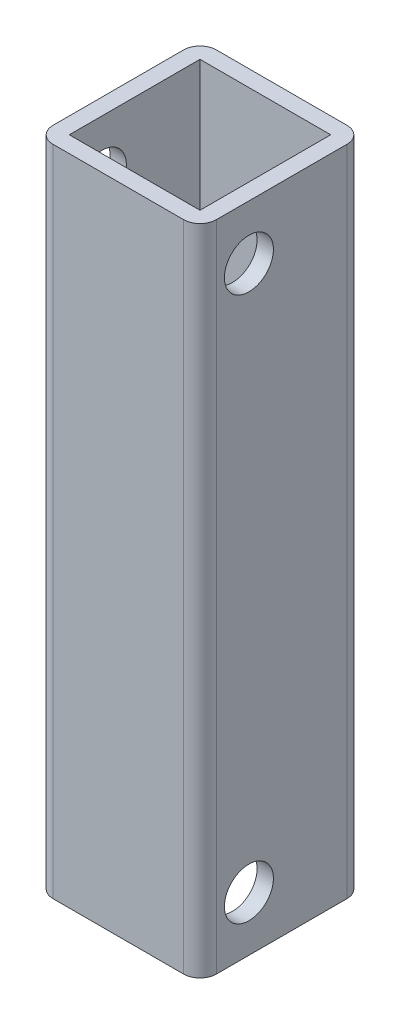
ISO-10303-21;
HEADER;
FILE_DESCRIPTION(('STEP AP214'),'2;1');
FILE_NAME('part.step','',(''),(''),'','','');
FILE_SCHEMA(('AUTOMOTIVE_DESIGN { 1 0 10303 214 1 1 1 1 }'));
ENDSEC;
DATA;
#1=APPLICATION_CONTEXT('core data for automotive mechanical design processes');
#2=APPLICATION_PROTOCOL_DEFINITION('international standard','automotive_design',2000,#1);
#3=PRODUCT_CONTEXT('',#1,'mechanical');
#4=PRODUCT('Part','Part','',(#3));
#5=PRODUCT_RELATED_PRODUCT_CATEGORY('part','',(#4));
#6=PRODUCT_DEFINITION_FORMATION('','',#4);
#7=PRODUCT_DEFINITION_CONTEXT('part definition',#1,'design');
#8=PRODUCT_DEFINITION('design','',#6,#7);
#9=PRODUCT_DEFINITION_SHAPE('','',#8);
#10=(LENGTH_UNIT() NAMED_UNIT(*) SI_UNIT(.MILLI.,.METRE.));
#11=(NAMED_UNIT(*) PLANE_ANGLE_UNIT() SI_UNIT($,.RADIAN.));
#12=(NAMED_UNIT(*) SI_UNIT($,.STERADIAN.) SOLID_ANGLE_UNIT());
#13=UNCERTAINTY_MEASURE_WITH_UNIT(LENGTH_MEASURE(1.E-05),#10,'distance_accuracy_value','');
#14=(GEOMETRIC_REPRESENTATION_CONTEXT(3) GLOBAL_UNCERTAINTY_ASSIGNED_CONTEXT((#13)) GLOBAL_UNIT_ASSIGNED_CONTEXT((#10,
#11,#12)) REPRESENTATION_CONTEXT('',''));
#15=CARTESIAN_POINT('',(0.,0.,0.));
#16=DIRECTION('',(0.,0.,1.));
#17=DIRECTION('',(1.,0.,0.));
#18=AXIS2_PLACEMENT_3D('',#15,#16,#17);
#19=CARTESIAN_POINT('',(-15.,507.9,-50.1201374153035));
#20=DIRECTION('',(-1.,0.,0.));
#21=DIRECTION('',(0.,0.,1.));
#22=AXIS2_PLACEMENT_3D('',#19,#20,#21);
#23=PLANE('',#22);
#24=CARTESIAN_POINT('',(-15.,397.934499999996,-29.1000000000331));
#25=DIRECTION('',(1.,0.,0.));
#26=DIRECTION('',(0.,0.,-1.));
#27=AXIS2_PLACEMENT_3D('',#24,#25,#26);
#28=CIRCLE('',#27,4.5);
#29=CARTESIAN_POINT('',(-15.,397.934499999996,-33.6000000000331));
#30=VERTEX_POINT('',#29);
#31=EDGE_CURVE('E423',#30,#30,#28,.T.);
#32=ORIENTED_EDGE('',*,*,#31,.T.);
#33=EDGE_LOOP('',(#32));
#34=FACE_BOUND('',#33,.T.);
#35=CARTESIAN_POINT('',(-15.,497.934499999996,-29.1000000000432));
#36=DIRECTION('',(1.,0.,0.));
#37=DIRECTION('',(0.,0.,-1.));
#38=AXIS2_PLACEMENT_3D('',#35,#36,#37);
#39=CIRCLE('',#38,4.5);
#40=CARTESIAN_POINT('',(-15.,497.934499999996,-33.6000000000432));
#41=VERTEX_POINT('',#40);
#42=EDGE_CURVE('E154',#41,#41,#39,.T.);
#43=ORIENTED_EDGE('',*,*,#42,.T.);
#44=EDGE_LOOP('',(#43));
#45=FACE_BOUND('',#44,.T.);
#46=DIRECTION('',(0.,0.,1.));
#47=VECTOR('',#46,1.);
#48=CARTESIAN_POINT('',(-15.,507.9,-50.1201374153035));
#49=LINE('',#48,#47);
#50=CARTESIAN_POINT('',(-15.,507.9,-47.1201374153035));
#51=VERTEX_POINT('',#50);
#52=CARTESIAN_POINT('',(-15.,507.9,-23.1201374153035));
#53=VERTEX_POINT('',#52);
#54=EDGE_CURVE('E182',#51,#53,#49,.T.);
#55=ORIENTED_EDGE('',*,*,#54,.F.);
#56=DIRECTION('',(0.,-1.,0.));
#57=VECTOR('',#56,1.);
#58=CARTESIAN_POINT('',(-15.,387.934536743125,-47.1201374153035));
#59=LINE('',#58,#57);
#60=CARTESIAN_POINT('',(-15.,387.934536743125,-47.1201374153035));
#61=VERTEX_POINT('',#60);
#62=EDGE_CURVE('E217',#51,#61,#59,.T.);
#63=ORIENTED_EDGE('',*,*,#62,.T.);
#64=DIRECTION('',(0.,0.,1.));
#65=VECTOR('',#64,1.);
#66=CARTESIAN_POINT('',(-15.,387.934536743125,-50.1201374153035));
#67=LINE('',#66,#65);
#68=CARTESIAN_POINT('',(-15.,387.934536743125,-23.1201374153035));
#69=VERTEX_POINT('',#68);
#70=EDGE_CURVE('E177',#61,#69,#67,.T.);
#71=ORIENTED_EDGE('',*,*,#70,.T.);
#72=DIRECTION('',(0.,-1.,0.));
#73=VECTOR('',#72,1.);
#74=CARTESIAN_POINT('',(-15.,507.9,-23.1201374153035));
#75=LINE('',#74,#73);
#76=EDGE_CURVE('E215',#69,#53,#75,.F.);
#77=ORIENTED_EDGE('',*,*,#76,.T.);
#78=EDGE_LOOP('',(#55,#63,#71,#77));
#79=FACE_BOUND('',#78,.T.);
#80=ADVANCED_FACE('F33',(#34,#45,#79),#23,.T.);
#81=CARTESIAN_POINT('',(15.,507.9,-50.1201374153035));
#82=DIRECTION('',(0.,1.,0.));
#83=DIRECTION('',(0.,0.,1.));
#84=AXIS2_PLACEMENT_3D('',#81,#82,#83);
#85=PLANE('',#84);
#86=DIRECTION('',(0.,0.,1.));
#87=VECTOR('',#86,1.);
#88=CARTESIAN_POINT('',(-12.,507.9,-47.1201374153035));
#89=LINE('',#88,#87);
#90=CARTESIAN_POINT('',(-12.,507.9,-47.1201374153035));
#91=VERTEX_POINT('',#90);
#92=CARTESIAN_POINT('',(-12.,507.9,-23.1201374153035));
#93=VERTEX_POINT('',#92);
#94=EDGE_CURVE('E131',#91,#93,#89,.T.);
#95=ORIENTED_EDGE('',*,*,#94,.F.);
#96=DIRECTION('',(-1.,0.,0.));
#97=VECTOR('',#96,1.);
#98=CARTESIAN_POINT('',(12.,507.9,-47.1201374153035));
#99=LINE('',#98,#97);
#100=CARTESIAN_POINT('',(12.,507.9,-47.1201374153035));
#101=VERTEX_POINT('',#100);
#102=EDGE_CURVE('E148',#101,#91,#99,.T.);
#103=ORIENTED_EDGE('',*,*,#102,.F.);
#104=DIRECTION('',(0.,0.,-1.));
#105=VECTOR('',#104,1.);
#106=CARTESIAN_POINT('',(12.,507.9,-23.1201374153035));
#107=LINE('',#106,#105);
#108=CARTESIAN_POINT('',(12.,507.9,-23.1201374153035));
#109=VERTEX_POINT('',#108);
#110=EDGE_CURVE('E151',#109,#101,#107,.T.);
#111=ORIENTED_EDGE('',*,*,#110,.F.);
#112=DIRECTION('',(1.,0.,0.));
#113=VECTOR('',#112,1.);
#114=CARTESIAN_POINT('',(-12.,507.9,-23.1201374153035));
#115=LINE('',#114,#113);
#116=EDGE_CURVE('E160',#93,#109,#115,.T.);
#117=ORIENTED_EDGE('',*,*,#116,.F.);
#118=EDGE_LOOP('',(#95,#103,#111,#117));
#119=FACE_BOUND('',#118,.T.);
#120=DIRECTION('',(0.,0.,1.));
#121=VECTOR('',#120,1.);
#122=CARTESIAN_POINT('',(15.,507.9,-50.1201374153035));
#123=LINE('',#122,#121);
#124=CARTESIAN_POINT('',(15.,507.9,-47.1201374153035));
#125=VERTEX_POINT('',#124);
#126=CARTESIAN_POINT('',(15.,507.9,-23.1201374153035));
#127=VERTEX_POINT('',#126);
#128=EDGE_CURVE('E186',#125,#127,#123,.T.);
#129=ORIENTED_EDGE('',*,*,#128,.F.);
#130=CARTESIAN_POINT('',(12.,507.9,-47.1201374153035));
#131=DIRECTION('',(0.,1.,0.));
#132=DIRECTION('',(0.,0.,1.));
#133=AXIS2_PLACEMENT_3D('',#130,#131,#132);
#134=CIRCLE('',#133,3.);
#135=CARTESIAN_POINT('',(12.,507.9,-50.1201374153035));
#136=VERTEX_POINT('',#135);
#137=EDGE_CURVE('E203',#125,#136,#134,.T.);
#138=ORIENTED_EDGE('',*,*,#137,.T.);
#139=DIRECTION('',(-1.,0.,0.));
#140=VECTOR('',#139,1.);
#141=CARTESIAN_POINT('',(15.,507.9,-50.1201374153035));
#142=LINE('',#141,#140);
#143=CARTESIAN_POINT('',(-12.,507.9,-50.1201374153035));
#144=VERTEX_POINT('',#143);
#145=EDGE_CURVE('E173',#136,#144,#142,.T.);
#146=ORIENTED_EDGE('',*,*,#145,.T.);
#147=CARTESIAN_POINT('',(-12.,507.9,-47.1201374153035));
#148=DIRECTION('',(0.,1.,0.));
#149=DIRECTION('',(0.,0.,1.));
#150=AXIS2_PLACEMENT_3D('',#147,#148,#149);
#151=CIRCLE('',#150,3.);
#152=EDGE_CURVE('E201',#144,#51,#151,.T.);
#153=ORIENTED_EDGE('',*,*,#152,.T.);
#154=ORIENTED_EDGE('',*,*,#54,.T.);
#155=CARTESIAN_POINT('',(-12.,507.9,-23.1201374153035));
#156=DIRECTION('',(0.,1.,0.));
#157=DIRECTION('',(0.,0.,1.));
#158=AXIS2_PLACEMENT_3D('',#155,#156,#157);
#159=CIRCLE('',#158,3.);
#160=CARTESIAN_POINT('',(-12.,507.9,-20.1201374153035));
#161=VERTEX_POINT('',#160);
#162=EDGE_CURVE('E197',#53,#161,#159,.T.);
#163=ORIENTED_EDGE('',*,*,#162,.T.);
#164=DIRECTION('',(-1.,0.,0.));
#165=VECTOR('',#164,1.);
#166=CARTESIAN_POINT('',(15.,507.9,-20.1201374153035));
#167=LINE('',#166,#165);
#168=CARTESIAN_POINT('',(12.,507.9,-20.1201374153035));
#169=VERTEX_POINT('',#168);
#170=EDGE_CURVE('E174',#169,#161,#167,.T.);
#171=ORIENTED_EDGE('',*,*,#170,.F.);
#172=CARTESIAN_POINT('',(12.,507.9,-23.1201374153035));
#173=DIRECTION('',(0.,1.,0.));
#174=DIRECTION('',(0.,0.,1.));
#175=AXIS2_PLACEMENT_3D('',#172,#173,#174);
#176=CIRCLE('',#175,3.);
#177=EDGE_CURVE('E199',#169,#127,#176,.T.);
#178=ORIENTED_EDGE('',*,*,#177,.T.);
#179=EDGE_LOOP('',(#129,#138,#146,#153,#154,#163,#171,#178));
#180=FACE_BOUND('',#179,.T.);
#181=ADVANCED_FACE('F233',(#119,#180),#85,.T.);
#182=CARTESIAN_POINT('',(15.,387.934536743125,-50.1201374153035));
#183=DIRECTION('',(1.,0.,0.));
#184=DIRECTION('',(0.,0.,-1.));
#185=AXIS2_PLACEMENT_3D('',#182,#183,#184);
#186=PLANE('',#185);
#187=CARTESIAN_POINT('',(15.,497.934499999996,-29.1000000000432));
#188=DIRECTION('',(1.,0.,0.));
#189=DIRECTION('',(0.,0.,-1.));
#190=AXIS2_PLACEMENT_3D('',#187,#188,#189);
#191=CIRCLE('',#190,4.5);
#192=CARTESIAN_POINT('',(15.,497.934499999996,-33.6000000000432));
#193=VERTEX_POINT('',#192);
#194=EDGE_CURVE('E437',#193,#193,#191,.T.);
#195=ORIENTED_EDGE('',*,*,#194,.F.);
#196=EDGE_LOOP('',(#195));
#197=FACE_BOUND('',#196,.T.);
#198=CARTESIAN_POINT('',(15.,397.934499999996,-29.1000000000331));
#199=DIRECTION('',(1.,0.,0.));
#200=DIRECTION('',(0.,0.,-1.));
#201=AXIS2_PLACEMENT_3D('',#198,#199,#200);
#202=CIRCLE('',#201,4.5);
#203=CARTESIAN_POINT('',(15.,397.934499999996,-33.6000000000331));
#204=VERTEX_POINT('',#203);
#205=EDGE_CURVE('E431',#204,#204,#202,.T.);
#206=ORIENTED_EDGE('',*,*,#205,.F.);
#207=EDGE_LOOP('',(#206));
#208=FACE_BOUND('',#207,.T.);
#209=DIRECTION('',(0.,0.,1.));
#210=VECTOR('',#209,1.);
#211=CARTESIAN_POINT('',(15.,387.934536743125,-50.1201374153035));
#212=LINE('',#211,#210);
#213=CARTESIAN_POINT('',(15.,387.934536743125,-47.1201374153035));
#214=VERTEX_POINT('',#213);
#215=CARTESIAN_POINT('',(15.,387.934536743125,-23.1201374153035));
#216=VERTEX_POINT('',#215);
#217=EDGE_CURVE('E189',#214,#216,#212,.T.);
#218=ORIENTED_EDGE('',*,*,#217,.F.);
#219=DIRECTION('',(0.,1.,0.));
#220=VECTOR('',#219,1.);
#221=CARTESIAN_POINT('',(15.,507.9,-47.1201374153035));
#222=LINE('',#221,#220);
#223=EDGE_CURVE('E194',#214,#125,#222,.T.);
#224=ORIENTED_EDGE('',*,*,#223,.T.);
#225=ORIENTED_EDGE('',*,*,#128,.T.);
#226=DIRECTION('',(0.,1.,0.));
#227=VECTOR('',#226,1.);
#228=CARTESIAN_POINT('',(15.,387.934536743125,-23.1201374153035));
#229=LINE('',#228,#227);
#230=EDGE_CURVE('E185',#127,#216,#229,.F.);
#231=ORIENTED_EDGE('',*,*,#230,.T.);
#232=EDGE_LOOP('',(#218,#224,#225,#231));
#233=FACE_BOUND('',#232,.T.);
#234=ADVANCED_FACE('F249',(#197,#208,#233),#186,.T.);
#235=CARTESIAN_POINT('',(-15.,387.934536743125,-50.1201374153035));
#236=DIRECTION('',(0.,-1.,0.));
#237=DIRECTION('',(0.,0.,-1.));
#238=AXIS2_PLACEMENT_3D('',#235,#236,#237);
#239=PLANE('',#238);
#240=DIRECTION('',(0.,0.,1.));
#241=VECTOR('',#240,1.);
#242=CARTESIAN_POINT('',(-12.,387.934536743125,-47.1201374153035));
#243=LINE('',#242,#241);
#244=CARTESIAN_POINT('',(-12.,387.934536743125,-47.1201374153035));
#245=VERTEX_POINT('',#244);
#246=CARTESIAN_POINT('',(-12.,387.934536743125,-23.1201374153035));
#247=VERTEX_POINT('',#246);
#248=EDGE_CURVE('E128',#245,#247,#243,.T.);
#249=ORIENTED_EDGE('',*,*,#248,.T.);
#250=DIRECTION('',(1.,0.,0.));
#251=VECTOR('',#250,1.);
#252=CARTESIAN_POINT('',(-12.,387.934536743125,-23.1201374153035));
#253=LINE('',#252,#251);
#254=CARTESIAN_POINT('',(12.,387.934536743125,-23.1201374153035));
#255=VERTEX_POINT('',#254);
#256=EDGE_CURVE('E140',#247,#255,#253,.T.);
#257=ORIENTED_EDGE('',*,*,#256,.T.);
#258=DIRECTION('',(0.,0.,-1.));
#259=VECTOR('',#258,1.);
#260=CARTESIAN_POINT('',(12.,387.934536743125,-23.1201374153035));
#261=LINE('',#260,#259);
#262=CARTESIAN_POINT('',(12.,387.934536743125,-47.1201374153035));
#263=VERTEX_POINT('',#262);
#264=EDGE_CURVE('E144',#255,#263,#261,.T.);
#265=ORIENTED_EDGE('',*,*,#264,.T.);
#266=DIRECTION('',(-1.,0.,0.));
#267=VECTOR('',#266,1.);
#268=CARTESIAN_POINT('',(12.,387.934536743125,-47.1201374153035));
#269=LINE('',#268,#267);
#270=EDGE_CURVE('E136',#263,#245,#269,.T.);
#271=ORIENTED_EDGE('',*,*,#270,.T.);
#272=EDGE_LOOP('',(#249,#257,#265,#271));
#273=FACE_BOUND('',#272,.T.);
#274=DIRECTION('',(1.,0.,0.));
#275=VECTOR('',#274,1.);
#276=CARTESIAN_POINT('',(-15.,387.934536743125,-50.1201374153035));
#277=LINE('',#276,#275);
#278=CARTESIAN_POINT('',(-12.,387.934536743125,-50.1201374153035));
#279=VERTEX_POINT('',#278);
#280=CARTESIAN_POINT('',(12.,387.934536743125,-50.1201374153035));
#281=VERTEX_POINT('',#280);
#282=EDGE_CURVE('E170',#279,#281,#277,.T.);
#283=ORIENTED_EDGE('',*,*,#282,.T.);
#284=CARTESIAN_POINT('',(12.,387.934536743125,-47.1201374153035));
#285=DIRECTION('',(0.,-1.,0.));
#286=DIRECTION('',(0.,0.,-1.));
#287=AXIS2_PLACEMENT_3D('',#284,#285,#286);
#288=CIRCLE('',#287,3.);
#289=EDGE_CURVE('E213',#281,#214,#288,.T.);
#290=ORIENTED_EDGE('',*,*,#289,.T.);
#291=ORIENTED_EDGE('',*,*,#217,.T.);
#292=CARTESIAN_POINT('',(12.,387.934536743125,-23.1201374153035));
#293=DIRECTION('',(0.,-1.,0.));
#294=DIRECTION('',(0.,0.,-1.));
#295=AXIS2_PLACEMENT_3D('',#292,#293,#294);
#296=CIRCLE('',#295,3.);
#297=CARTESIAN_POINT('',(12.,387.934536743125,-20.1201374153035));
#298=VERTEX_POINT('',#297);
#299=EDGE_CURVE('E210',#216,#298,#296,.T.);
#300=ORIENTED_EDGE('',*,*,#299,.T.);
#301=DIRECTION('',(1.,0.,0.));
#302=VECTOR('',#301,1.);
#303=CARTESIAN_POINT('',(-15.,387.934536743125,-20.1201374153035));
#304=LINE('',#303,#302);
#305=CARTESIAN_POINT('',(-12.,387.934536743125,-20.1201374153035));
#306=VERTEX_POINT('',#305);
#307=EDGE_CURVE('E166',#306,#298,#304,.T.);
#308=ORIENTED_EDGE('',*,*,#307,.F.);
#309=CARTESIAN_POINT('',(-12.,387.934536743125,-23.1201374153035));
#310=DIRECTION('',(0.,-1.,0.));
#311=DIRECTION('',(0.,0.,-1.));
#312=AXIS2_PLACEMENT_3D('',#309,#310,#311);
#313=CIRCLE('',#312,3.);
#314=EDGE_CURVE('E48',#306,#69,#313,.T.);
#315=ORIENTED_EDGE('',*,*,#314,.T.);
#316=ORIENTED_EDGE('',*,*,#70,.F.);
#317=CARTESIAN_POINT('',(-12.,387.934536743125,-47.1201374153035));
#318=DIRECTION('',(0.,-1.,0.));
#319=DIRECTION('',(0.,0.,-1.));
#320=AXIS2_PLACEMENT_3D('',#317,#318,#319);
#321=CIRCLE('',#320,3.);
#322=EDGE_CURVE('E56',#61,#279,#321,.T.);
#323=ORIENTED_EDGE('',*,*,#322,.T.);
#324=EDGE_LOOP('',(#283,#290,#291,#300,#308,#315,#316,#323));
#325=FACE_BOUND('',#324,.T.);
#326=ADVANCED_FACE('F146',(#273,#325),#239,.T.);
#327=CARTESIAN_POINT('',(0.,0.,-50.1201374153035));
#328=DIRECTION('',(0.,0.,1.));
#329=DIRECTION('',(1.,0.,0.));
#330=AXIS2_PLACEMENT_3D('',#327,#328,#329);
#331=PLANE('',#330);
#332=ORIENTED_EDGE('',*,*,#145,.F.);
#333=DIRECTION('',(0.,1.,0.));
#334=VECTOR('',#333,1.);
#335=CARTESIAN_POINT('',(12.,387.934536743125,-50.1201374153035));
#336=LINE('',#335,#334);
#337=EDGE_CURVE('E207',#136,#281,#336,.F.);
#338=ORIENTED_EDGE('',*,*,#337,.T.);
#339=ORIENTED_EDGE('',*,*,#282,.F.);
#340=DIRECTION('',(0.,-1.,0.));
#341=VECTOR('',#340,1.);
#342=CARTESIAN_POINT('',(-12.,507.9,-50.1201374153035));
#343=LINE('',#342,#341);
#344=EDGE_CURVE('E205',#279,#144,#343,.F.);
#345=ORIENTED_EDGE('',*,*,#344,.T.);
#346=EDGE_LOOP('',(#332,#338,#339,#345));
#347=FACE_BOUND('',#346,.T.);
#348=ADVANCED_FACE('F241',(#347),#331,.F.);
#349=CARTESIAN_POINT('',(0.,0.,-20.1201374153035));
#350=DIRECTION('',(0.,0.,1.));
#351=DIRECTION('',(1.,0.,0.));
#352=AXIS2_PLACEMENT_3D('',#349,#350,#351);
#353=PLANE('',#352);
#354=ORIENTED_EDGE('',*,*,#307,.T.);
#355=DIRECTION('',(0.,1.,0.));
#356=VECTOR('',#355,1.);
#357=CARTESIAN_POINT('',(12.,0.,-20.1201374153035));
#358=LINE('',#357,#356);
#359=EDGE_CURVE('E11',#298,#169,#358,.T.);
#360=ORIENTED_EDGE('',*,*,#359,.T.);
#361=ORIENTED_EDGE('',*,*,#170,.T.);
#362=DIRECTION('',(0.,-1.,0.));
#363=VECTOR('',#362,1.);
#364=CARTESIAN_POINT('',(-12.,0.,-20.1201374153035));
#365=LINE('',#364,#363);
#366=EDGE_CURVE('E41',#161,#306,#365,.T.);
#367=ORIENTED_EDGE('',*,*,#366,.T.);
#368=EDGE_LOOP('',(#354,#360,#361,#367));
#369=FACE_BOUND('',#368,.T.);
#370=ADVANCED_FACE('F221',(#369),#353,.T.);
#371=CARTESIAN_POINT('',(-12.,387.934536743125,-47.1201374153035));
#372=DIRECTION('',(-1.,0.,0.));
#373=DIRECTION('',(0.,0.,1.));
#374=AXIS2_PLACEMENT_3D('',#371,#372,#373);
#375=PLANE('',#374);
#376=CARTESIAN_POINT('',(-12.,397.934499999996,-29.1000000000331));
#377=DIRECTION('',(1.,0.,0.));
#378=DIRECTION('',(0.,0.,-1.));
#379=AXIS2_PLACEMENT_3D('',#376,#377,#378);
#380=CIRCLE('',#379,4.5);
#381=CARTESIAN_POINT('',(-12.,397.934499999996,-33.6000000000331));
#382=VERTEX_POINT('',#381);
#383=EDGE_CURVE('E418',#382,#382,#380,.T.);
#384=ORIENTED_EDGE('',*,*,#383,.F.);
#385=EDGE_LOOP('',(#384));
#386=FACE_BOUND('',#385,.T.);
#387=CARTESIAN_POINT('',(-12.,497.934499999996,-29.1000000000432));
#388=DIRECTION('',(1.,0.,0.));
#389=DIRECTION('',(0.,0.,-1.));
#390=AXIS2_PLACEMENT_3D('',#387,#388,#389);
#391=CIRCLE('',#390,4.5);
#392=CARTESIAN_POINT('',(-12.,497.934499999996,-33.6000000000432));
#393=VERTEX_POINT('',#392);
#394=EDGE_CURVE('E421',#393,#393,#391,.T.);
#395=ORIENTED_EDGE('',*,*,#394,.F.);
#396=EDGE_LOOP('',(#395));
#397=FACE_BOUND('',#396,.T.);
#398=ORIENTED_EDGE('',*,*,#94,.T.);
#399=DIRECTION('',(0.,1.,0.));
#400=VECTOR('',#399,1.);
#401=CARTESIAN_POINT('',(-12.,387.934536743125,-23.1201374153035));
#402=LINE('',#401,#400);
#403=EDGE_CURVE('E124',#247,#93,#402,.T.);
#404=ORIENTED_EDGE('',*,*,#403,.F.);
#405=ORIENTED_EDGE('',*,*,#248,.F.);
#406=DIRECTION('',(0.,1.,0.));
#407=VECTOR('',#406,1.);
#408=CARTESIAN_POINT('',(-12.,387.934536743125,-47.1201374153035));
#409=LINE('',#408,#407);
#410=EDGE_CURVE('E164',#245,#91,#409,.T.);
#411=ORIENTED_EDGE('',*,*,#410,.T.);
#412=EDGE_LOOP('',(#398,#404,#405,#411));
#413=FACE_BOUND('',#412,.T.);
#414=ADVANCED_FACE('F126',(#386,#397,#413),#375,.F.);
#415=CARTESIAN_POINT('',(12.,387.934536743125,-47.1201374153035));
#416=DIRECTION('',(0.,0.,-1.));
#417=DIRECTION('',(-1.,0.,0.));
#418=AXIS2_PLACEMENT_3D('',#415,#416,#417);
#419=PLANE('',#418);
#420=ORIENTED_EDGE('',*,*,#102,.T.);
#421=ORIENTED_EDGE('',*,*,#410,.F.);
#422=ORIENTED_EDGE('',*,*,#270,.F.);
#423=DIRECTION('',(0.,1.,0.));
#424=VECTOR('',#423,1.);
#425=CARTESIAN_POINT('',(12.,387.934536743125,-47.1201374153035));
#426=LINE('',#425,#424);
#427=EDGE_CURVE('E167',#263,#101,#426,.T.);
#428=ORIENTED_EDGE('',*,*,#427,.T.);
#429=EDGE_LOOP('',(#420,#421,#422,#428));
#430=FACE_BOUND('',#429,.T.);
#431=ADVANCED_FACE('F366',(#430),#419,.F.);
#432=CARTESIAN_POINT('',(12.,387.934536743125,-23.1201374153035));
#433=DIRECTION('',(1.,0.,0.));
#434=DIRECTION('',(0.,0.,-1.));
#435=AXIS2_PLACEMENT_3D('',#432,#433,#434);
#436=PLANE('',#435);
#437=CARTESIAN_POINT('',(12.,497.934499999996,-29.1000000000432));
#438=DIRECTION('',(1.,0.,0.));
#439=DIRECTION('',(0.,0.,-1.));
#440=AXIS2_PLACEMENT_3D('',#437,#438,#439);
#441=CIRCLE('',#440,4.5);
#442=CARTESIAN_POINT('',(12.,497.934499999996,-33.6000000000432));
#443=VERTEX_POINT('',#442);
#444=EDGE_CURVE('E434',#443,#443,#441,.T.);
#445=ORIENTED_EDGE('',*,*,#444,.T.);
#446=EDGE_LOOP('',(#445));
#447=FACE_BOUND('',#446,.T.);
#448=CARTESIAN_POINT('',(12.,397.934499999996,-29.1000000000331));
#449=DIRECTION('',(1.,0.,0.));
#450=DIRECTION('',(0.,0.,-1.));
#451=AXIS2_PLACEMENT_3D('',#448,#449,#450);
#452=CIRCLE('',#451,4.5);
#453=CARTESIAN_POINT('',(12.,397.934499999996,-33.6000000000331));
#454=VERTEX_POINT('',#453);
#455=EDGE_CURVE('E428',#454,#454,#452,.T.);
#456=ORIENTED_EDGE('',*,*,#455,.T.);
#457=EDGE_LOOP('',(#456));
#458=FACE_BOUND('',#457,.T.);
#459=ORIENTED_EDGE('',*,*,#110,.T.);
#460=ORIENTED_EDGE('',*,*,#427,.F.);
#461=ORIENTED_EDGE('',*,*,#264,.F.);
#462=DIRECTION('',(0.,1.,0.));
#463=VECTOR('',#462,1.);
#464=CARTESIAN_POINT('',(12.,387.934536743125,-23.1201374153035));
#465=LINE('',#464,#463);
#466=EDGE_CURVE('E135',#255,#109,#465,.T.);
#467=ORIENTED_EDGE('',*,*,#466,.T.);
#468=EDGE_LOOP('',(#459,#460,#461,#467));
#469=FACE_BOUND('',#468,.T.);
#470=ADVANCED_FACE('F361',(#447,#458,#469),#436,.F.);
#471=CARTESIAN_POINT('',(-12.,387.934536743125,-23.1201374153035));
#472=DIRECTION('',(0.,0.,1.));
#473=DIRECTION('',(1.,0.,0.));
#474=AXIS2_PLACEMENT_3D('',#471,#472,#473);
#475=PLANE('',#474);
#476=ORIENTED_EDGE('',*,*,#116,.T.);
#477=ORIENTED_EDGE('',*,*,#466,.F.);
#478=ORIENTED_EDGE('',*,*,#256,.F.);
#479=ORIENTED_EDGE('',*,*,#403,.T.);
#480=EDGE_LOOP('',(#476,#477,#478,#479));
#481=FACE_BOUND('',#480,.T.);
#482=ADVANCED_FACE('F141',(#481),#475,.F.);
#483=CARTESIAN_POINT('',(-12.,497.934499999996,-29.1000000000432));
#484=DIRECTION('',(1.,0.,0.));
#485=DIRECTION('',(0.,0.,-1.));
#486=AXIS2_PLACEMENT_3D('',#483,#484,#485);
#487=CYLINDRICAL_SURFACE('',#486,4.5);
#488=ORIENTED_EDGE('',*,*,#42,.F.);
#489=EDGE_LOOP('',(#488));
#490=FACE_BOUND('',#489,.T.);
#491=ORIENTED_EDGE('',*,*,#394,.T.);
#492=EDGE_LOOP('',(#491));
#493=FACE_BOUND('',#492,.T.);
#494=ADVANCED_FACE('F378',(#490,#493),#487,.F.);
#495=CARTESIAN_POINT('',(-12.,397.934499999996,-29.1000000000331));
#496=DIRECTION('',(1.,0.,0.));
#497=DIRECTION('',(0.,0.,-1.));
#498=AXIS2_PLACEMENT_3D('',#495,#496,#497);
#499=CYLINDRICAL_SURFACE('',#498,4.5);
#500=ORIENTED_EDGE('',*,*,#31,.F.);
#501=EDGE_LOOP('',(#500));
#502=FACE_BOUND('',#501,.T.);
#503=ORIENTED_EDGE('',*,*,#383,.T.);
#504=EDGE_LOOP('',(#503));
#505=FACE_BOUND('',#504,.T.);
#506=ADVANCED_FACE('F353',(#502,#505),#499,.F.);
#507=CARTESIAN_POINT('',(15.,397.934499999996,-29.1000000000331));
#508=DIRECTION('',(1.,0.,0.));
#509=DIRECTION('',(0.,0.,-1.));
#510=AXIS2_PLACEMENT_3D('',#507,#508,#509);
#511=CYLINDRICAL_SURFACE('',#510,4.5);
#512=ORIENTED_EDGE('',*,*,#205,.T.);
#513=EDGE_LOOP('',(#512));
#514=FACE_BOUND('',#513,.T.);
#515=ORIENTED_EDGE('',*,*,#455,.F.);
#516=EDGE_LOOP('',(#515));
#517=FACE_BOUND('',#516,.T.);
#518=ADVANCED_FACE('F343',(#514,#517),#511,.F.);
#519=CARTESIAN_POINT('',(15.,497.934499999996,-29.1000000000432));
#520=DIRECTION('',(1.,0.,0.));
#521=DIRECTION('',(0.,0.,-1.));
#522=AXIS2_PLACEMENT_3D('',#519,#520,#521);
#523=CYLINDRICAL_SURFACE('',#522,4.5);
#524=ORIENTED_EDGE('',*,*,#194,.T.);
#525=EDGE_LOOP('',(#524));
#526=FACE_BOUND('',#525,.T.);
#527=ORIENTED_EDGE('',*,*,#444,.F.);
#528=EDGE_LOOP('',(#527));
#529=FACE_BOUND('',#528,.T.);
#530=ADVANCED_FACE('F272',(#526,#529),#523,.F.);
#531=CARTESIAN_POINT('',(12.,387.934536743125,-47.1201374153035));
#532=DIRECTION('',(0.,-1.,0.));
#533=DIRECTION('',(0.,0.,-1.));
#534=AXIS2_PLACEMENT_3D('',#531,#532,#533);
#535=CYLINDRICAL_SURFACE('',#534,3.);
#536=ORIENTED_EDGE('',*,*,#289,.F.);
#537=ORIENTED_EDGE('',*,*,#337,.F.);
#538=ORIENTED_EDGE('',*,*,#137,.F.);
#539=ORIENTED_EDGE('',*,*,#223,.F.);
#540=EDGE_LOOP('',(#536,#537,#538,#539));
#541=FACE_BOUND('',#540,.T.);
#542=ADVANCED_FACE('F246',(#541),#535,.T.);
#543=CARTESIAN_POINT('',(-12.,507.9,-47.1201374153035));
#544=DIRECTION('',(0.,1.,0.));
#545=DIRECTION('',(0.,0.,1.));
#546=AXIS2_PLACEMENT_3D('',#543,#544,#545);
#547=CYLINDRICAL_SURFACE('',#546,3.);
#548=ORIENTED_EDGE('',*,*,#152,.F.);
#549=ORIENTED_EDGE('',*,*,#344,.F.);
#550=ORIENTED_EDGE('',*,*,#322,.F.);
#551=ORIENTED_EDGE('',*,*,#62,.F.);
#552=EDGE_LOOP('',(#548,#549,#550,#551));
#553=FACE_BOUND('',#552,.T.);
#554=ADVANCED_FACE('F244',(#553),#547,.T.);
#555=CARTESIAN_POINT('',(12.,0.,-23.1201374153035));
#556=DIRECTION('',(0.,1.,0.));
#557=DIRECTION('',(0.,0.,1.));
#558=AXIS2_PLACEMENT_3D('',#555,#556,#557);
#559=CYLINDRICAL_SURFACE('',#558,3.);
#560=ORIENTED_EDGE('',*,*,#299,.F.);
#561=ORIENTED_EDGE('',*,*,#230,.F.);
#562=ORIENTED_EDGE('',*,*,#177,.F.);
#563=ORIENTED_EDGE('',*,*,#359,.F.);
#564=EDGE_LOOP('',(#560,#561,#562,#563));
#565=FACE_BOUND('',#564,.T.);
#566=ADVANCED_FACE('F230',(#565),#559,.T.);
#567=CARTESIAN_POINT('',(-12.,0.,-23.1201374153035));
#568=DIRECTION('',(0.,-1.,0.));
#569=DIRECTION('',(0.,0.,-1.));
#570=AXIS2_PLACEMENT_3D('',#567,#568,#569);
#571=CYLINDRICAL_SURFACE('',#570,3.);
#572=ORIENTED_EDGE('',*,*,#162,.F.);
#573=ORIENTED_EDGE('',*,*,#76,.F.);
#574=ORIENTED_EDGE('',*,*,#314,.F.);
#575=ORIENTED_EDGE('',*,*,#366,.F.);
#576=EDGE_LOOP('',(#572,#573,#574,#575));
#577=FACE_BOUND('',#576,.T.);
#578=ADVANCED_FACE('F35',(#577),#571,.T.);
#579=CLOSED_SHELL('',(#80,#181,#234,#326,#348,#370,#414,#431,#470,#482,#494,#506,#518,#530,#542,
#554,#566,#578));
#580=MANIFOLD_SOLID_BREP('B2',#579);
#581=ADVANCED_BREP_SHAPE_REPRESENTATION('',(#18,#580),#14);
#582=SHAPE_DEFINITION_REPRESENTATION(#9,#581);
ENDSEC;
END-ISO-10303-21;
